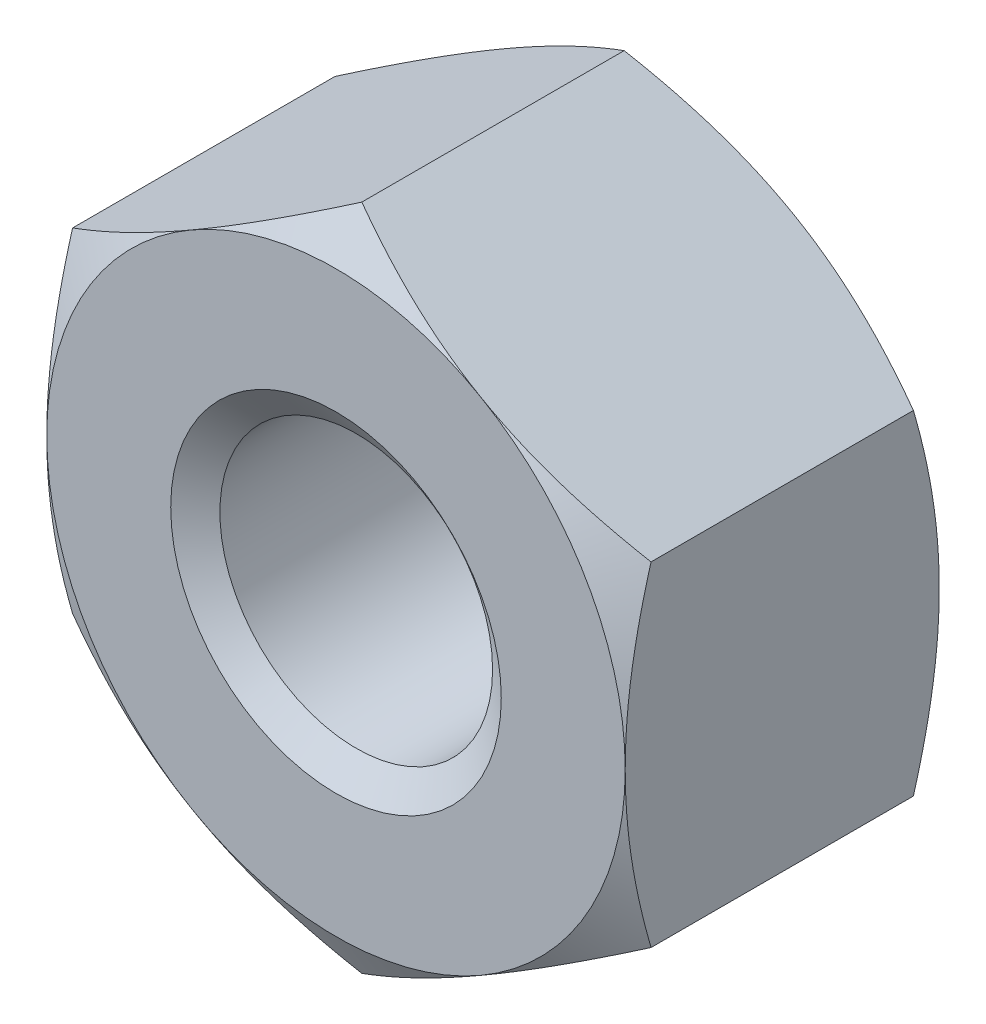
ISO-10303-21;
HEADER;
FILE_DESCRIPTION(('STEP AP214'),'2;1');
FILE_NAME('part.step','',(''),(''),'','','');
FILE_SCHEMA(('AUTOMOTIVE_DESIGN { 1 0 10303 214 1 1 1 1 }'));
ENDSEC;
DATA;
#1=APPLICATION_CONTEXT('core data for automotive mechanical design processes');
#2=APPLICATION_PROTOCOL_DEFINITION('international standard','automotive_design',2000,#1);
#3=PRODUCT_CONTEXT('',#1,'mechanical');
#4=PRODUCT('Part','Part','',(#3));
#5=PRODUCT_RELATED_PRODUCT_CATEGORY('part','',(#4));
#6=PRODUCT_DEFINITION_FORMATION('','',#4);
#7=PRODUCT_DEFINITION_CONTEXT('part definition',#1,'design');
#8=PRODUCT_DEFINITION('design','',#6,#7);
#9=PRODUCT_DEFINITION_SHAPE('','',#8);
#10=(LENGTH_UNIT() NAMED_UNIT(*) SI_UNIT(.MILLI.,.METRE.));
#11=(NAMED_UNIT(*) PLANE_ANGLE_UNIT() SI_UNIT($,.RADIAN.));
#12=(NAMED_UNIT(*) SI_UNIT($,.STERADIAN.) SOLID_ANGLE_UNIT());
#13=UNCERTAINTY_MEASURE_WITH_UNIT(LENGTH_MEASURE(1.E-05),#10,'distance_accuracy_value','');
#14=(GEOMETRIC_REPRESENTATION_CONTEXT(3) GLOBAL_UNCERTAINTY_ASSIGNED_CONTEXT((#13)) GLOBAL_UNIT_ASSIGNED_CONTEXT((#10,
#11,#12)) REPRESENTATION_CONTEXT('',''));
#15=CARTESIAN_POINT('',(0.,0.,0.));
#16=DIRECTION('',(0.,0.,1.));
#17=DIRECTION('',(1.,0.,0.));
#18=AXIS2_PLACEMENT_3D('',#15,#16,#17);
#19=CARTESIAN_POINT('',(0.,0.,-3.8));
#20=DIRECTION('',(0.,0.,1.));
#21=DIRECTION('',(1.,0.,0.));
#22=AXIS2_PLACEMENT_3D('',#19,#20,#21);
#23=CYLINDRICAL_SURFACE('',#22,1.65);
#24=CARTESIAN_POINT('',(0.,0.,-0.245072638373399));
#25=DIRECTION('',(0.,0.,1.));
#26=DIRECTION('',(1.,0.,0.));
#27=AXIS2_PLACEMENT_3D('',#24,#25,#26);
#28=CIRCLE('',#27,1.65);
#29=CARTESIAN_POINT('',(1.65,0.,-0.245072638373399));
#30=VERTEX_POINT('',#29);
#31=EDGE_CURVE('E174',#30,#30,#28,.F.);
#32=CARTESIAN_POINT('',(0.,0.,-3.5295273616266));
#33=DIRECTION('',(0.,0.,-1.));
#34=DIRECTION('',(-1.,0.,0.));
#35=AXIS2_PLACEMENT_3D('',#32,#33,#34);
#36=CIRCLE('',#35,1.65);
#37=CARTESIAN_POINT('',(1.65,0.,-3.5295273616266));
#38=VERTEX_POINT('',#37);
#39=EDGE_CURVE('E39',#38,#38,#36,.F.);
#40=CARTESIAN_POINT('',(1.65,0.,-0.245072638373399));
#41=CARTESIAN_POINT('',(1.65,0.,-0.279285708407287));
#42=CARTESIAN_POINT('',(1.65,0.,-0.313498778441174));
#43=CARTESIAN_POINT('',(1.65,0.,-0.381924918508949));
#44=CARTESIAN_POINT('',(1.65,0.,-0.416137988542837));
#45=CARTESIAN_POINT('',(1.65,0.,-0.484564128610612));
#46=CARTESIAN_POINT('',(1.65,0.,-0.518777198644499));
#47=CARTESIAN_POINT('',(1.65,0.,-0.587203338712274));
#48=CARTESIAN_POINT('',(1.65,0.,-0.621416408746162));
#49=CARTESIAN_POINT('',(1.65,0.,-0.689842548813937));
#50=CARTESIAN_POINT('',(1.65,0.,-0.724055618847824));
#51=CARTESIAN_POINT('',(1.65,0.,-0.792481758915599));
#52=CARTESIAN_POINT('',(1.65,0.,-0.826694828949487));
#53=CARTESIAN_POINT('',(1.65,0.,-0.895120969017262));
#54=CARTESIAN_POINT('',(1.65,0.,-0.929334039051149));
#55=CARTESIAN_POINT('',(1.65,0.,-0.997760179118924));
#56=CARTESIAN_POINT('',(1.65,0.,-1.03197324915281));
#57=CARTESIAN_POINT('',(1.65,0.,-1.10039938922059));
#58=CARTESIAN_POINT('',(1.65,0.,-1.13461245925447));
#59=CARTESIAN_POINT('',(1.65,0.,-1.20303859932225));
#60=CARTESIAN_POINT('',(1.65,0.,-1.23725166935614));
#61=CARTESIAN_POINT('',(1.65,0.,-1.30567780942391));
#62=CARTESIAN_POINT('',(1.65,0.,-1.3398908794578));
#63=CARTESIAN_POINT('',(1.65,0.,-1.40831701952557));
#64=CARTESIAN_POINT('',(1.65,0.,-1.44253008955946));
#65=CARTESIAN_POINT('',(1.65,0.,-1.51095622962724));
#66=CARTESIAN_POINT('',(1.65,0.,-1.54516929966112));
#67=CARTESIAN_POINT('',(1.65,0.,-1.6135954397289));
#68=CARTESIAN_POINT('',(1.65,0.,-1.64780850976279));
#69=CARTESIAN_POINT('',(1.65,0.,-1.71623464983056));
#70=CARTESIAN_POINT('',(1.65,0.,-1.75044771986445));
#71=CARTESIAN_POINT('',(1.65,0.,-1.81887385993222));
#72=CARTESIAN_POINT('',(1.65,0.,-1.85308692996611));
#73=CARTESIAN_POINT('',(1.65,0.,-1.92151307003389));
#74=CARTESIAN_POINT('',(1.65,0.,-1.95572614006777));
#75=CARTESIAN_POINT('',(1.65,0.,-2.02415228013555));
#76=CARTESIAN_POINT('',(1.65,0.,-2.05836535016944));
#77=CARTESIAN_POINT('',(1.65,0.,-2.12679149023721));
#78=CARTESIAN_POINT('',(1.65,0.,-2.1610045602711));
#79=CARTESIAN_POINT('',(1.65,0.,-2.22943070033887));
#80=CARTESIAN_POINT('',(1.65,0.,-2.26364377037276));
#81=CARTESIAN_POINT('',(1.65,0.,-2.33206991044054));
#82=CARTESIAN_POINT('',(1.65,0.,-2.36628298047442));
#83=CARTESIAN_POINT('',(1.65,0.,-2.4347091205422));
#84=CARTESIAN_POINT('',(1.65,0.,-2.46892219057609));
#85=CARTESIAN_POINT('',(1.65,0.,-2.53734833064386));
#86=CARTESIAN_POINT('',(1.65,0.,-2.57156140067775));
#87=CARTESIAN_POINT('',(1.65,0.,-2.63998754074552));
#88=CARTESIAN_POINT('',(1.65,0.,-2.67420061077941));
#89=CARTESIAN_POINT('',(1.65,0.,-2.74262675084719));
#90=CARTESIAN_POINT('',(1.65,0.,-2.77683982088107));
#91=CARTESIAN_POINT('',(1.65,0.,-2.84526596094885));
#92=CARTESIAN_POINT('',(1.65,0.,-2.87947903098274));
#93=CARTESIAN_POINT('',(1.65,0.,-2.94790517105051));
#94=CARTESIAN_POINT('',(1.65,0.,-2.9821182410844));
#95=CARTESIAN_POINT('',(1.65,0.,-3.05054438115217));
#96=CARTESIAN_POINT('',(1.65,0.,-3.08475745118606));
#97=CARTESIAN_POINT('',(1.65,0.,-3.15318359125384));
#98=CARTESIAN_POINT('',(1.65,0.,-3.18739666128773));
#99=CARTESIAN_POINT('',(1.65,0.,-3.2558228013555));
#100=CARTESIAN_POINT('',(1.65,0.,-3.29003587138939));
#101=CARTESIAN_POINT('',(1.65,0.,-3.35846201145716));
#102=CARTESIAN_POINT('',(1.65,0.,-3.39267508149105));
#103=CARTESIAN_POINT('',(1.65,0.,-3.46110122155882));
#104=CARTESIAN_POINT('',(1.65,0.,-3.49531429159271));
#105=CARTESIAN_POINT('',(1.65,0.,-3.5295273616266));
#106=B_SPLINE_CURVE_WITH_KNOTS('',3,(#40,#41,#42,#43,#44,#45,#46,#47,#48,#49,#50,#51,#52,#53,
#54,#55,#56,#57,#58,#59,#60,#61,#62,#63,#64,#65,#66,#67,#68,#69,#70,#71,#72,#73,#74,#75,#76,#77,
#78,#79,#80,#81,#82,#83,#84,#85,#86,#87,#88,#89,#90,#91,#92,#93,#94,#95,#96,#97,#98,#99,#100,
#101,#102,#103,#104,#105),.UNSPECIFIED.,.F.,.F.,(4,2,2,2,2,2,2,2,2,2,2,2,2,2,2,2,2,2,2,2,2,2,2,
2,2,2,2,2,2,2,2,2,4),(0.,0.102639210101662,0.205278420203325,0.307917630304987,0.41055684040665,
0.513196050508312,0.615835260609975,0.718474470711638,0.8211136808133,0.923752890914963,
1.02639210101663,1.12903131111829,1.23167052121995,1.33430973132161,1.43694894142328,
1.53958815152494,1.6422273616266,1.74486657172826,1.84750578182993,1.95014499193159,
2.05278420203325,2.15542341213491,2.25806262223658,2.36070183233824,2.4633410424399,
2.56598025254156,2.66861946264323,2.77125867274489,2.87389788284655,2.97653709294821,
3.07917630304988,3.18181551315154,3.2844547232532),.UNSPECIFIED.);
#107=EDGE_CURVE('BSEAM34',#30,#38,#106,.T.);
#108=ORIENTED_EDGE('',*,*,#31,.F.);
#109=ORIENTED_EDGE('',*,*,#39,.F.);
#110=ORIENTED_EDGE('',*,*,#107,.T.);
#111=ORIENTED_EDGE('',*,*,#107,.F.);
#112=EDGE_LOOP('',(#108,#110,#109,#111));
#113=FACE_BOUND('',#112,.T.);
#114=ADVANCED_FACE('F34',(#113),#23,.F.);
#115=CARTESIAN_POINT('',(0.,4.04145188432738,-3.8));
#116=DIRECTION('',(-0.500000000000001,0.866025403784438,0.));
#117=DIRECTION('',(-0.866025403784438,-0.500000000000001,0.));
#118=AXIS2_PLACEMENT_3D('',#115,#116,#117);
#119=PLANE('',#118);
#120=DIRECTION('',(0.,0.,1.));
#121=VECTOR('',#120,1.);
#122=CARTESIAN_POINT('',(-3.5,2.02072594216369,-3.8));
#123=LINE('',#122,#121);
#124=CARTESIAN_POINT('',(-3.5,2.02072594216369,-3.48739260883035));
#125=VERTEX_POINT('',#124);
#126=CARTESIAN_POINT('',(-3.5,2.02072594216369,-0.312607391169643));
#127=VERTEX_POINT('',#126);
#128=EDGE_CURVE('E164',#125,#127,#123,.T.);
#129=ORIENTED_EDGE('',*,*,#128,.T.);
#130=CARTESIAN_POINT('',(-3.5002,2.02061047210985,-0.312674060693371));
#131=CARTESIAN_POINT('',(-3.34639282154755,2.10941108799267,-0.261385788989983));
#132=CARTESIAN_POINT('',(-3.19125798916558,2.19897822522909,-0.214740953816197));
#133=CARTESIAN_POINT('',(-2.87830199342322,2.37966345361545,-0.133321875533348));
#134=CARTESIAN_POINT('',(-2.7204752692125,2.47078475532382,-0.0985764355845608));
#135=CARTESIAN_POINT('',(-2.40677778961987,2.65189807961073,-0.0444900271828353));
#136=CARTESIAN_POINT('',(-2.25095530083931,2.74186223545399,-0.0247890862603807));
#137=CARTESIAN_POINT('',(-1.93857711279463,2.92221386641056,-0.00127013273725369));
#138=CARTESIAN_POINT('',(-1.78202254896577,3.01260068598001,0.00256735545443515));
#139=CARTESIAN_POINT('',(-1.48949078007901,3.1814939814933,-0.00541530187697757));
#140=CARTESIAN_POINT('',(-1.35346978754209,3.26002573814993,-0.015275434069607));
#141=CARTESIAN_POINT('',(-1.08231397971101,3.41657761679354,-0.0465264668994037));
#142=CARTESIAN_POINT('',(-0.947180102315317,3.49459719728458,-0.0679280432857986));
#143=CARTESIAN_POINT('',(-0.675465207594817,3.65147186489429,-0.121430407880578));
#144=CARTESIAN_POINT('',(-0.538918580721665,3.73030709667644,-0.153757994445088));
#145=CARTESIAN_POINT('',(-0.267861907055499,3.88680174018324,-0.227128933807996));
#146=CARTESIAN_POINT('',(-0.133348387531464,3.96446315689009,-0.268155046569869));
#147=CARTESIAN_POINT('',(0.000199999999999687,4.04156735438122,-0.312674060693373));
#148=B_SPLINE_CURVE_WITH_KNOTS('',3,(#130,#131,#132,#133,#134,#135,#136,#137,#138,#139,#140,
#141,#142,#143,#144,#145,#146,#147),.UNSPECIFIED.,.F.,.F.,(4,2,2,2,2,2,2,2,4),(0.,
0.554793832886254,1.11092123814984,1.65328467083219,2.19498204478403,2.6666513085086,
3.13875761298267,3.6213361260051,4.10296698719187),.UNSPECIFIED.);
#149=CARTESIAN_POINT('',(-1.75,3.03108891324553,0.));
#150=VERTEX_POINT('',#149);
#151=EDGE_CURVE('E133',#127,#150,#148,.T.);
#152=ORIENTED_EDGE('',*,*,#151,.T.);
#153=CARTESIAN_POINT('',(0.,4.04145188432738,-0.312607391169645));
#154=VERTEX_POINT('',#153);
#155=EDGE_CURVE('E53',#150,#154,#148,.T.);
#156=ORIENTED_EDGE('',*,*,#155,.T.);
#157=DIRECTION('',(0.,0.,1.));
#158=VECTOR('',#157,1.);
#159=CARTESIAN_POINT('',(0.,4.04145188432738,-3.8));
#160=LINE('',#159,#158);
#161=CARTESIAN_POINT('',(0.,4.04145188432738,-3.48739260883035));
#162=VERTEX_POINT('',#161);
#163=EDGE_CURVE('E149',#162,#154,#160,.T.);
#164=ORIENTED_EDGE('',*,*,#163,.F.);
#165=CARTESIAN_POINT('',(-3.5002,2.02061047210985,-3.48732593930663));
#166=CARTESIAN_POINT('',(-3.34639282154755,2.10941108799267,-3.53861421101002));
#167=CARTESIAN_POINT('',(-3.19125798916558,2.19897822522909,-3.5852590461838));
#168=CARTESIAN_POINT('',(-2.87830199342322,2.37966345361545,-3.66667812446665));
#169=CARTESIAN_POINT('',(-2.7204752692125,2.47078475532382,-3.70142356441544));
#170=CARTESIAN_POINT('',(-2.40677778961987,2.65189807961073,-3.75550997281716));
#171=CARTESIAN_POINT('',(-2.25095530083931,2.74186223545399,-3.77521091373962));
#172=CARTESIAN_POINT('',(-1.93857711279463,2.92221386641056,-3.79872986726275));
#173=CARTESIAN_POINT('',(-1.78202254896577,3.01260068598001,-3.80256735545444));
#174=CARTESIAN_POINT('',(-1.48949078007901,3.1814939814933,-3.79458469812302));
#175=CARTESIAN_POINT('',(-1.35346978754209,3.26002573814993,-3.78472456593039));
#176=CARTESIAN_POINT('',(-1.08231397971101,3.41657761679354,-3.7534735331006));
#177=CARTESIAN_POINT('',(-0.947180102315317,3.49459719728458,-3.7320719567142));
#178=CARTESIAN_POINT('',(-0.675465207594816,3.65147186489429,-3.67856959211942));
#179=CARTESIAN_POINT('',(-0.538918580721665,3.73030709667644,-3.64624200555491));
#180=CARTESIAN_POINT('',(-0.267861907055499,3.88680174018324,-3.572871066192));
#181=CARTESIAN_POINT('',(-0.133348387531464,3.96446315689009,-3.53184495343013));
#182=CARTESIAN_POINT('',(0.000199999999999684,4.04156735438122,-3.48732593930663));
#183=B_SPLINE_CURVE_WITH_KNOTS('',3,(#165,#166,#167,#168,#169,#170,#171,#172,#173,#174,#175,
#176,#177,#178,#179,#180,#181,#182),.UNSPECIFIED.,.F.,.F.,(4,2,2,2,2,2,2,2,4),(0.,
0.554793832886255,1.11092123814984,1.65328467083219,2.19498204478403,2.6666513085086,
3.13875761298267,3.6213361260051,4.10296698719187),.UNSPECIFIED.);
#184=CARTESIAN_POINT('',(-1.75,3.03108891324553,-3.8));
#185=VERTEX_POINT('',#184);
#186=EDGE_CURVE('E167',#185,#162,#183,.T.);
#187=ORIENTED_EDGE('',*,*,#186,.F.);
#188=EDGE_CURVE('E259',#125,#185,#183,.T.);
#189=ORIENTED_EDGE('',*,*,#188,.F.);
#190=EDGE_LOOP('',(#129,#152,#156,#164,#187,#189));
#191=FACE_BOUND('',#190,.T.);
#192=ADVANCED_FACE('F36',(#191),#119,.T.);
#193=CARTESIAN_POINT('',(3.5,2.02072594216369,-3.8));
#194=DIRECTION('',(0.500000000000001,0.866025403784438,0.));
#195=DIRECTION('',(-0.866025403784438,0.500000000000001,0.));
#196=AXIS2_PLACEMENT_3D('',#193,#194,#195);
#197=PLANE('',#196);
#198=ORIENTED_EDGE('',*,*,#163,.T.);
#199=CARTESIAN_POINT('',(-0.000200000000000259,4.04156735438122,-0.312674060693373));
#200=CARTESIAN_POINT('',(0.153607178452449,3.9527667384984,-0.261385788989986));
#201=CARTESIAN_POINT('',(0.308742010834424,3.86319960126198,-0.214740953816199));
#202=CARTESIAN_POINT('',(0.621698006576782,3.68251437287562,-0.13332187553335));
#203=CARTESIAN_POINT('',(0.779524730787496,3.59139307116725,-0.0985764355845619));
#204=CARTESIAN_POINT('',(1.09322221038013,3.41027974688034,-0.0444900271828362));
#205=CARTESIAN_POINT('',(1.24904469916069,3.32031559103708,-0.0247890862603816));
#206=CARTESIAN_POINT('',(1.56142288720538,3.13996396008052,-0.00127013273725425));
#207=CARTESIAN_POINT('',(1.71797745103423,3.04957714051106,0.00256735545443501));
#208=CARTESIAN_POINT('',(2.01050921992099,2.88068384499777,-0.00541530187697743));
#209=CARTESIAN_POINT('',(2.14653021245791,2.80215208834114,-0.0152754340696069));
#210=CARTESIAN_POINT('',(2.417686020289,2.64560020969753,-0.0465264668994034));
#211=CARTESIAN_POINT('',(2.55281989768468,2.5675806292065,-0.067928043285798));
#212=CARTESIAN_POINT('',(2.82453479240518,2.41070596159678,-0.121430407880577));
#213=CARTESIAN_POINT('',(2.96108141927834,2.33187072981463,-0.153757994445087));
#214=CARTESIAN_POINT('',(3.2321380929445,2.17537608630783,-0.227128933807994));
#215=CARTESIAN_POINT('',(3.36665161246854,2.09771466960098,-0.268155046569867));
#216=CARTESIAN_POINT('',(3.5002,2.02061047210985,-0.312674060693371));
#217=B_SPLINE_CURVE_WITH_KNOTS('',3,(#199,#200,#201,#202,#203,#204,#205,#206,#207,#208,#209,
#210,#211,#212,#213,#214,#215,#216),.UNSPECIFIED.,.F.,.F.,(4,2,2,2,2,2,2,2,4),(0.,
0.554793832886255,1.11092123814984,1.65328467083219,2.19498204478403,2.6666513085086,
3.13875761298267,3.6213361260051,4.10296698719187),.UNSPECIFIED.);
#218=CARTESIAN_POINT('',(1.75,3.03108891324553,0.));
#219=VERTEX_POINT('',#218);
#220=EDGE_CURVE('E143',#154,#219,#217,.T.);
#221=ORIENTED_EDGE('',*,*,#220,.T.);
#222=CARTESIAN_POINT('',(3.5,2.02072594216369,-0.312607391169645));
#223=VERTEX_POINT('',#222);
#224=EDGE_CURVE('E60',#219,#223,#217,.T.);
#225=ORIENTED_EDGE('',*,*,#224,.T.);
#226=DIRECTION('',(0.,0.,1.));
#227=VECTOR('',#226,1.);
#228=CARTESIAN_POINT('',(3.5,2.02072594216369,-3.8));
#229=LINE('',#228,#227);
#230=CARTESIAN_POINT('',(3.5,2.02072594216369,-3.48739260883035));
#231=VERTEX_POINT('',#230);
#232=EDGE_CURVE('E142',#231,#223,#229,.T.);
#233=ORIENTED_EDGE('',*,*,#232,.F.);
#234=CARTESIAN_POINT('',(-0.000200000000000244,4.04156735438122,-3.48732593930663));
#235=CARTESIAN_POINT('',(0.153607178452449,3.9527667384984,-3.53861421101001));
#236=CARTESIAN_POINT('',(0.308742010834424,3.86319960126198,-3.5852590461838));
#237=CARTESIAN_POINT('',(0.621698006576782,3.68251437287562,-3.66667812446665));
#238=CARTESIAN_POINT('',(0.779524730787496,3.59139307116725,-3.70142356441544));
#239=CARTESIAN_POINT('',(1.09322221038013,3.41027974688034,-3.75550997281716));
#240=CARTESIAN_POINT('',(1.24904469916069,3.32031559103708,-3.77521091373962));
#241=CARTESIAN_POINT('',(1.56142288720538,3.13996396008052,-3.79872986726275));
#242=CARTESIAN_POINT('',(1.71797745103423,3.04957714051106,-3.80256735545443));
#243=CARTESIAN_POINT('',(2.01050921992099,2.88068384499777,-3.79458469812302));
#244=CARTESIAN_POINT('',(2.14653021245791,2.80215208834114,-3.78472456593039));
#245=CARTESIAN_POINT('',(2.417686020289,2.64560020969753,-3.7534735331006));
#246=CARTESIAN_POINT('',(2.55281989768468,2.5675806292065,-3.7320719567142));
#247=CARTESIAN_POINT('',(2.82453479240518,2.41070596159678,-3.67856959211942));
#248=CARTESIAN_POINT('',(2.96108141927834,2.33187072981463,-3.64624200555491));
#249=CARTESIAN_POINT('',(3.2321380929445,2.17537608630783,-3.57287106619201));
#250=CARTESIAN_POINT('',(3.36665161246854,2.09771466960098,-3.53184495343013));
#251=CARTESIAN_POINT('',(3.5002,2.02061047210985,-3.48732593930663));
#252=B_SPLINE_CURVE_WITH_KNOTS('',3,(#234,#235,#236,#237,#238,#239,#240,#241,#242,#243,#244,
#245,#246,#247,#248,#249,#250,#251),.UNSPECIFIED.,.F.,.F.,(4,2,2,2,2,2,2,2,4),(0.,
0.554793832886255,1.11092123814984,1.65328467083219,2.19498204478403,2.6666513085086,
3.13875761298267,3.6213361260051,4.10296698719187),.UNSPECIFIED.);
#253=CARTESIAN_POINT('',(1.75,3.03108891324553,-3.8));
#254=VERTEX_POINT('',#253);
#255=EDGE_CURVE('E253',#254,#231,#252,.T.);
#256=ORIENTED_EDGE('',*,*,#255,.F.);
#257=EDGE_CURVE('E258',#162,#254,#252,.T.);
#258=ORIENTED_EDGE('',*,*,#257,.F.);
#259=EDGE_LOOP('',(#198,#221,#225,#233,#256,#258));
#260=FACE_BOUND('',#259,.T.);
#261=ADVANCED_FACE('F140',(#260),#197,.T.);
#262=CARTESIAN_POINT('',(3.5,2.02072594216369,-3.8));
#263=DIRECTION('',(-1.,0.,0.));
#264=DIRECTION('',(0.,0.,1.));
#265=AXIS2_PLACEMENT_3D('',#262,#263,#264);
#266=PLANE('',#265);
#267=CARTESIAN_POINT('',(3.5,-5.35926299121405,-1.67484346858556));
#268=CARTESIAN_POINT('',(3.5,-5.20559319908842,-1.60058173692104));
#269=CARTESIAN_POINT('',(3.5,-5.05156008083375,-1.52705822833147));
#270=CARTESIAN_POINT('',(3.5,-4.7425707418071,-1.38190950344752));
#271=CARTESIAN_POINT('',(3.5,-4.58761436682436,-1.31028461582133));
#272=CARTESIAN_POINT('',(3.5,-4.27574500225542,-1.16897765517624));
#273=CARTESIAN_POINT('',(3.5,-4.11882589028192,-1.09930904568016));
#274=CARTESIAN_POINT('',(3.5,-3.80369792903855,-0.96296426224276));
#275=CARTESIAN_POINT('',(3.5,-3.64548914750595,-0.896287932319518));
#276=CARTESIAN_POINT('',(3.5,-3.32556618401855,-0.765931819095067));
#277=CARTESIAN_POINT('',(3.5,-3.16383281219923,-0.702298873688864));
#278=CARTESIAN_POINT('',(3.5,-2.83845840945597,-0.580016702089492));
#279=CARTESIAN_POINT('',(3.5,-2.67481716858826,-0.521368030370691));
#280=CARTESIAN_POINT('',(3.5,-2.34570278472049,-0.410630279877021));
#281=CARTESIAN_POINT('',(3.5,-2.18023438248742,-0.358527255435857));
#282=CARTESIAN_POINT('',(3.5,-1.8469452280637,-0.262572936976443));
#283=CARTESIAN_POINT('',(3.5,-1.6791252378753,-0.218719033467158));
#284=CARTESIAN_POINT('',(3.5,-1.34101828610925,-0.141391945584786));
#285=CARTESIAN_POINT('',(3.5,-1.17073068027693,-0.107921525211972));
#286=CARTESIAN_POINT('',(3.5,-0.828102385138484,-0.0536149564320502));
#287=CARTESIAN_POINT('',(3.5,-0.655761694017301,-0.0327788191952362));
#288=CARTESIAN_POINT('',(3.5,-0.311020490924449,-0.00558408650575641));
#289=CARTESIAN_POINT('',(3.5,-0.138627397207259,0.00086616316591138));
#290=CARTESIAN_POINT('',(3.5,0.206038074906536,-0.00105355807794622));
#291=CARTESIAN_POINT('',(3.5,0.37831047302318,-0.00941968196343206));
#292=CARTESIAN_POINT('',(3.5,0.672490555822328,-0.035768892786892));
#293=CARTESIAN_POINT('',(3.5,0.794722791084093,-0.0503206340384212));
#294=CARTESIAN_POINT('',(3.5,1.0382430543056,-0.0859367340533556));
#295=CARTESIAN_POINT('',(3.5,1.15953093025887,-0.107002119926141));
#296=CARTESIAN_POINT('',(3.5,1.52187914771348,-0.178863187081453));
#297=CARTESIAN_POINT('',(3.5,1.76124104212632,-0.23830527562201));
#298=CARTESIAN_POINT('',(3.5,2.11940971387708,-0.340826814402554));
#299=CARTESIAN_POINT('',(3.5,2.24008344316346,-0.377749699085183));
#300=CARTESIAN_POINT('',(3.5,2.48017139213728,-0.455249007699293));
#301=CARTESIAN_POINT('',(3.5,2.59958641795613,-0.49582291166355));
#302=CARTESIAN_POINT('',(3.5,2.83665760451798,-0.579779986782753));
#303=CARTESIAN_POINT('',(3.5,2.95431988203483,-0.623146060034315));
#304=CARTESIAN_POINT('',(3.5,3.188731535088,-0.712423559566867));
#305=CARTESIAN_POINT('',(3.5,3.30548051959464,-0.758336014592951));
#306=CARTESIAN_POINT('',(3.5,3.42180736613349,-0.805270380724071));
#307=B_SPLINE_CURVE_WITH_KNOTS('',3,(#267,#268,#269,#270,#271,#272,#273,#274,#275,#276,#277,
#278,#279,#280,#281,#282,#283,#284,#285,#286,#287,#288,#289,#290,#291,#292,#293,#294,#295,#296,
#297,#298,#299,#300,#301,#302,#303,#304,#305,#306),.UNSPECIFIED.,.F.,.F.,(4,2,2,2,2,2,2,2,2,2,2,
2,2,2,2,2,2,2,2,4),(0.,0.512025318465737,1.02413870177436,1.53918270315241,2.05419982499224,
2.57553975872798,3.09693761309353,3.617205066104,4.13730766217537,4.65754858684364,
5.17778997146961,5.69470725122282,6.211490334524,6.58059623222331,6.94976036239485,
7.68863804939851,8.06719621660478,8.4454950747676,8.82166461280099,9.1979872473341),.UNSPECIFIED.);
#308=CARTESIAN_POINT('',(3.5,-2.02072594216369,-0.312607391169645));
#309=VERTEX_POINT('',#308);
#310=CARTESIAN_POINT('',(3.5,0.,0.));
#311=VERTEX_POINT('',#310);
#312=EDGE_CURVE('E135',#309,#311,#307,.T.);
#313=ORIENTED_EDGE('',*,*,#312,.F.);
#314=DIRECTION('',(0.,0.,1.));
#315=VECTOR('',#314,1.);
#316=CARTESIAN_POINT('',(3.5,-2.02072594216369,-3.8));
#317=LINE('',#316,#315);
#318=CARTESIAN_POINT('',(3.5,-2.02072594216369,-3.48739260883035));
#319=VERTEX_POINT('',#318);
#320=EDGE_CURVE('E150',#319,#309,#317,.T.);
#321=ORIENTED_EDGE('',*,*,#320,.F.);
#322=CARTESIAN_POINT('',(3.5,-5.35926299121405,-2.12515653141444));
#323=CARTESIAN_POINT('',(3.5,-5.20559319908841,-2.19941826307896));
#324=CARTESIAN_POINT('',(3.5,-5.05156008083375,-2.27294177166853));
#325=CARTESIAN_POINT('',(3.5,-4.7425707418071,-2.41809049655248));
#326=CARTESIAN_POINT('',(3.5,-4.58761436682436,-2.48971538417867));
#327=CARTESIAN_POINT('',(3.5,-4.27574500225542,-2.63102234482376));
#328=CARTESIAN_POINT('',(3.5,-4.11882589028192,-2.70069095431984));
#329=CARTESIAN_POINT('',(3.5,-3.80369792903855,-2.83703573775724));
#330=CARTESIAN_POINT('',(3.5,-3.64548914750595,-2.90371206768048));
#331=CARTESIAN_POINT('',(3.5,-3.32556618401855,-3.03406818090493));
#332=CARTESIAN_POINT('',(3.5,-3.16383281219923,-3.09770112631114));
#333=CARTESIAN_POINT('',(3.5,-2.83845840945597,-3.21998329791051));
#334=CARTESIAN_POINT('',(3.5,-2.67481716858826,-3.27863196962931));
#335=CARTESIAN_POINT('',(3.5,-2.34570278472049,-3.38936972012298));
#336=CARTESIAN_POINT('',(3.5,-2.18023438248742,-3.44147274456414));
#337=CARTESIAN_POINT('',(3.5,-1.8469452280637,-3.53742706302356));
#338=CARTESIAN_POINT('',(3.5,-1.6791252378753,-3.58128096653284));
#339=CARTESIAN_POINT('',(3.5,-1.34101828610925,-3.65860805441521));
#340=CARTESIAN_POINT('',(3.5,-1.17073068027693,-3.69207847478803));
#341=CARTESIAN_POINT('',(3.5,-0.828102385138483,-3.74638504356795));
#342=CARTESIAN_POINT('',(3.5,-0.655761694017301,-3.76722118080476));
#343=CARTESIAN_POINT('',(3.5,-0.311020490924449,-3.79441591349424));
#344=CARTESIAN_POINT('',(3.5,-0.138627397207259,-3.80086616316591));
#345=CARTESIAN_POINT('',(3.5,0.206038074906536,-3.79894644192205));
#346=CARTESIAN_POINT('',(3.5,0.378310473023181,-3.79058031803657));
#347=CARTESIAN_POINT('',(3.5,0.672490555822328,-3.76423110721311));
#348=CARTESIAN_POINT('',(3.5,0.794722791084093,-3.74967936596158));
#349=CARTESIAN_POINT('',(3.5,1.0382430543056,-3.71406326594664));
#350=CARTESIAN_POINT('',(3.5,1.15953093025887,-3.69299788007386));
#351=CARTESIAN_POINT('',(3.5,1.52187914771348,-3.62113681291855));
#352=CARTESIAN_POINT('',(3.5,1.76124104212632,-3.56169472437799));
#353=CARTESIAN_POINT('',(3.5,2.11940971387708,-3.45917318559745));
#354=CARTESIAN_POINT('',(3.5,2.24008344316346,-3.42225030091482));
#355=CARTESIAN_POINT('',(3.5,2.48017139213728,-3.34475099230071));
#356=CARTESIAN_POINT('',(3.5,2.59958641795613,-3.30417708833645));
#357=CARTESIAN_POINT('',(3.5,2.83665760451798,-3.22022001321725));
#358=CARTESIAN_POINT('',(3.5,2.95431988203483,-3.17685393996569));
#359=CARTESIAN_POINT('',(3.5,3.188731535088,-3.08757644043313));
#360=CARTESIAN_POINT('',(3.5,3.30548051959464,-3.04166398540705));
#361=CARTESIAN_POINT('',(3.5,3.42180736613349,-2.99472961927593));
#362=B_SPLINE_CURVE_WITH_KNOTS('',3,(#322,#323,#324,#325,#326,#327,#328,#329,#330,#331,#332,
#333,#334,#335,#336,#337,#338,#339,#340,#341,#342,#343,#344,#345,#346,#347,#348,#349,#350,#351,
#352,#353,#354,#355,#356,#357,#358,#359,#360,#361),.UNSPECIFIED.,.F.,.F.,(4,2,2,2,2,2,2,2,2,2,2,
2,2,2,2,2,2,2,2,4),(0.,0.512025318465738,1.02413870177436,1.53918270315241,2.05419982499224,
2.57553975872798,3.09693761309353,3.617205066104,4.13730766217537,4.65754858684365,
5.17778997146961,5.69470725122282,6.21149033452401,6.58059623222331,6.94976036239485,
7.68863804939851,8.06719621660478,8.4454950747676,8.82166461280099,9.1979872473341),.UNSPECIFIED.);
#363=CARTESIAN_POINT('',(3.5,0.,-3.8));
#364=VERTEX_POINT('',#363);
#365=EDGE_CURVE('E265',#319,#364,#362,.T.);
#366=ORIENTED_EDGE('',*,*,#365,.T.);
#367=EDGE_CURVE('E148',#364,#231,#362,.T.);
#368=ORIENTED_EDGE('',*,*,#367,.T.);
#369=ORIENTED_EDGE('',*,*,#232,.T.);
#370=EDGE_CURVE('E125',#311,#223,#307,.T.);
#371=ORIENTED_EDGE('',*,*,#370,.F.);
#372=EDGE_LOOP('',(#313,#321,#366,#368,#369,#371));
#373=FACE_BOUND('',#372,.T.);
#374=ADVANCED_FACE('F146',(#373),#266,.F.);
#375=CARTESIAN_POINT('',(0.,-4.04145188432739,-3.8));
#376=DIRECTION('',(0.500000000000001,-0.866025403784438,0.));
#377=DIRECTION('',(0.866025403784438,0.500000000000001,0.));
#378=AXIS2_PLACEMENT_3D('',#375,#376,#377);
#379=PLANE('',#378);
#380=ORIENTED_EDGE('',*,*,#320,.T.);
#381=CARTESIAN_POINT('',(3.5002,-2.02061047210985,-0.312674060693373));
#382=CARTESIAN_POINT('',(3.34639282154755,-2.10941108799267,-0.261385788989985));
#383=CARTESIAN_POINT('',(3.19125798916558,-2.19897822522909,-0.214740953816198));
#384=CARTESIAN_POINT('',(2.87830199342322,-2.37966345361545,-0.13332187553335));
#385=CARTESIAN_POINT('',(2.7204752692125,-2.47078475532382,-0.0985764355845621));
#386=CARTESIAN_POINT('',(2.40677778961987,-2.65189807961074,-0.0444900271828368));
#387=CARTESIAN_POINT('',(2.25095530083931,-2.741862235454,-0.0247890862603824));
#388=CARTESIAN_POINT('',(1.93857711279463,-2.92221386641056,-0.00127013273725548));
#389=CARTESIAN_POINT('',(1.78202254896577,-3.01260068598001,0.0025673554544335));
#390=CARTESIAN_POINT('',(1.48949078007901,-3.1814939814933,-0.0054153018769794));
#391=CARTESIAN_POINT('',(1.35346978754209,-3.26002573814993,-0.0152754340696091));
#392=CARTESIAN_POINT('',(1.082313979711,-3.41657761679354,-0.0465264668994058));
#393=CARTESIAN_POINT('',(0.947180102315317,-3.49459719728458,-0.0679280432858004));
#394=CARTESIAN_POINT('',(0.675465207594816,-3.65147186489429,-0.12143040788058));
#395=CARTESIAN_POINT('',(0.538918580721664,-3.73030709667644,-0.15375799444509));
#396=CARTESIAN_POINT('',(0.267861907055498,-3.88680174018325,-0.227128933807997));
#397=CARTESIAN_POINT('',(0.133348387531464,-3.96446315689009,-0.26815504656987));
#398=CARTESIAN_POINT('',(-0.000199999999999696,-4.04156735438122,-0.312674060693374));
#399=B_SPLINE_CURVE_WITH_KNOTS('',3,(#381,#382,#383,#384,#385,#386,#387,#388,#389,#390,#391,
#392,#393,#394,#395,#396,#397,#398),.UNSPECIFIED.,.F.,.F.,(4,2,2,2,2,2,2,2,4),(0.,
0.554793832886254,1.11092123814984,1.65328467083219,2.19498204478403,2.6666513085086,
3.13875761298267,3.6213361260051,4.10296698719187),.UNSPECIFIED.);
#400=CARTESIAN_POINT('',(1.75,-3.03108891324553,0.));
#401=VERTEX_POINT('',#400);
#402=EDGE_CURVE('E359',#309,#401,#399,.T.);
#403=ORIENTED_EDGE('',*,*,#402,.T.);
#404=CARTESIAN_POINT('',(0.,-4.04145188432738,-0.312607391169645));
#405=VERTEX_POINT('',#404);
#406=EDGE_CURVE('E225',#401,#405,#399,.T.);
#407=ORIENTED_EDGE('',*,*,#406,.T.);
#408=DIRECTION('',(0.,0.,1.));
#409=VECTOR('',#408,1.);
#410=CARTESIAN_POINT('',(0.,-4.04145188432739,-3.8));
#411=LINE('',#410,#409);
#412=CARTESIAN_POINT('',(0.,-4.04145188432738,-3.48739260883035));
#413=VERTEX_POINT('',#412);
#414=EDGE_CURVE('E155',#413,#405,#411,.T.);
#415=ORIENTED_EDGE('',*,*,#414,.F.);
#416=CARTESIAN_POINT('',(3.5002,-2.02061047210985,-3.48732593930663));
#417=CARTESIAN_POINT('',(3.34639282154755,-2.10941108799267,-3.53861421101001));
#418=CARTESIAN_POINT('',(3.19125798916558,-2.19897822522909,-3.5852590461838));
#419=CARTESIAN_POINT('',(2.87830199342322,-2.37966345361545,-3.66667812446665));
#420=CARTESIAN_POINT('',(2.7204752692125,-2.47078475532382,-3.70142356441544));
#421=CARTESIAN_POINT('',(2.40677778961987,-2.65189807961074,-3.75550997281716));
#422=CARTESIAN_POINT('',(2.25095530083931,-2.741862235454,-3.77521091373962));
#423=CARTESIAN_POINT('',(1.93857711279463,-2.92221386641056,-3.79872986726274));
#424=CARTESIAN_POINT('',(1.78202254896577,-3.01260068598001,-3.80256735545443));
#425=CARTESIAN_POINT('',(1.48949078007901,-3.1814939814933,-3.79458469812302));
#426=CARTESIAN_POINT('',(1.35346978754209,-3.26002573814993,-3.78472456593039));
#427=CARTESIAN_POINT('',(1.082313979711,-3.41657761679354,-3.75347353310059));
#428=CARTESIAN_POINT('',(0.947180102315317,-3.49459719728458,-3.7320719567142));
#429=CARTESIAN_POINT('',(0.675465207594816,-3.65147186489429,-3.67856959211942));
#430=CARTESIAN_POINT('',(0.538918580721664,-3.73030709667644,-3.64624200555491));
#431=CARTESIAN_POINT('',(0.267861907055499,-3.88680174018325,-3.572871066192));
#432=CARTESIAN_POINT('',(0.133348387531464,-3.96446315689009,-3.53184495343013));
#433=CARTESIAN_POINT('',(-0.000199999999999572,-4.04156735438122,-3.48732593930663));
#434=B_SPLINE_CURVE_WITH_KNOTS('',3,(#416,#417,#418,#419,#420,#421,#422,#423,#424,#425,#426,
#427,#428,#429,#430,#431,#432,#433),.UNSPECIFIED.,.F.,.F.,(4,2,2,2,2,2,2,2,4),(0.,
0.554793832886254,1.11092123814984,1.65328467083219,2.19498204478403,2.6666513085086,
3.13875761298267,3.6213361260051,4.10296698719187),.UNSPECIFIED.);
#435=CARTESIAN_POINT('',(1.75,-3.03108891324553,-3.8));
#436=VERTEX_POINT('',#435);
#437=EDGE_CURVE('E271',#436,#413,#434,.T.);
#438=ORIENTED_EDGE('',*,*,#437,.F.);
#439=EDGE_CURVE('E270',#319,#436,#434,.T.);
#440=ORIENTED_EDGE('',*,*,#439,.F.);
#441=EDGE_LOOP('',(#380,#403,#407,#415,#438,#440));
#442=FACE_BOUND('',#441,.T.);
#443=ADVANCED_FACE('F281',(#442),#379,.T.);
#444=CARTESIAN_POINT('',(-3.5,-2.02072594216369,-3.8));
#445=DIRECTION('',(-0.5,-0.866025403784438,0.));
#446=DIRECTION('',(0.866025403784439,-0.5,0.));
#447=AXIS2_PLACEMENT_3D('',#444,#445,#446);
#448=PLANE('',#447);
#449=ORIENTED_EDGE('',*,*,#414,.T.);
#450=CARTESIAN_POINT('',(0.00020000000000025,-4.04156735438122,-0.312674060693375));
#451=CARTESIAN_POINT('',(-0.15360717845245,-3.9527667384984,-0.261385788989987));
#452=CARTESIAN_POINT('',(-0.308742010834424,-3.86319960126198,-0.2147409538162));
#453=CARTESIAN_POINT('',(-0.621698006576782,-3.68251437287563,-0.133321875533351));
#454=CARTESIAN_POINT('',(-0.779524730787497,-3.59139307116725,-0.0985764355845636));
#455=CARTESIAN_POINT('',(-1.09322221038013,-3.41027974688034,-0.044490027182838));
#456=CARTESIAN_POINT('',(-1.24904469916069,-3.32031559103708,-0.0247890862603833));
#457=CARTESIAN_POINT('',(-1.56142288720538,-3.13996396008052,-0.00127013273725583));
#458=CARTESIAN_POINT('',(-1.71797745103423,-3.04957714051106,0.00256735545443338));
#459=CARTESIAN_POINT('',(-2.01050921992099,-2.88068384499778,-0.00541530187697918));
#460=CARTESIAN_POINT('',(-2.14653021245791,-2.80215208834115,-0.0152754340696087));
#461=CARTESIAN_POINT('',(-2.417686020289,-2.64560020969754,-0.0465264668994052));
#462=CARTESIAN_POINT('',(-2.55281989768468,-2.5675806292065,-0.0679280432857997));
#463=CARTESIAN_POINT('',(-2.82453479240518,-2.41070596159679,-0.121430407880579));
#464=CARTESIAN_POINT('',(-2.96108141927834,-2.33187072981464,-0.153757994445088));
#465=CARTESIAN_POINT('',(-3.2321380929445,-2.17537608630783,-0.227128933807996));
#466=CARTESIAN_POINT('',(-3.36665161246854,-2.09771466960099,-0.268155046569869));
#467=CARTESIAN_POINT('',(-3.5002,-2.02061047210986,-0.312674060693372));
#468=B_SPLINE_CURVE_WITH_KNOTS('',3,(#450,#451,#452,#453,#454,#455,#456,#457,#458,#459,#460,
#461,#462,#463,#464,#465,#466,#467),.UNSPECIFIED.,.F.,.F.,(4,2,2,2,2,2,2,2,4),(0.,
0.554793832886255,1.11092123814984,1.65328467083219,2.19498204478403,2.6666513085086,
3.13875761298267,3.6213361260051,4.10296698719187),.UNSPECIFIED.);
#469=CARTESIAN_POINT('',(-1.75,-3.03108891324554,0.));
#470=VERTEX_POINT('',#469);
#471=EDGE_CURVE('E356',#405,#470,#468,.T.);
#472=ORIENTED_EDGE('',*,*,#471,.T.);
#473=CARTESIAN_POINT('',(-3.5,-2.02072594216369,-0.312607391169645));
#474=VERTEX_POINT('',#473);
#475=EDGE_CURVE('E199',#470,#474,#468,.T.);
#476=ORIENTED_EDGE('',*,*,#475,.T.);
#477=DIRECTION('',(0.,0.,1.));
#478=VECTOR('',#477,1.);
#479=CARTESIAN_POINT('',(-3.5,-2.02072594216369,-3.8));
#480=LINE('',#479,#478);
#481=CARTESIAN_POINT('',(-3.5,-2.02072594216369,-3.48739260883035));
#482=VERTEX_POINT('',#481);
#483=EDGE_CURVE('E161',#482,#474,#480,.T.);
#484=ORIENTED_EDGE('',*,*,#483,.F.);
#485=CARTESIAN_POINT('',(0.00020000000000025,-4.04156735438122,-3.48732593930663));
#486=CARTESIAN_POINT('',(-0.153607178452449,-3.9527667384984,-3.53861421101001));
#487=CARTESIAN_POINT('',(-0.308742010834424,-3.86319960126198,-3.5852590461838));
#488=CARTESIAN_POINT('',(-0.621698006576782,-3.68251437287563,-3.66667812446665));
#489=CARTESIAN_POINT('',(-0.779524730787497,-3.59139307116725,-3.70142356441544));
#490=CARTESIAN_POINT('',(-1.09322221038013,-3.41027974688034,-3.75550997281716));
#491=CARTESIAN_POINT('',(-1.24904469916069,-3.32031559103708,-3.77521091373962));
#492=CARTESIAN_POINT('',(-1.56142288720538,-3.13996396008052,-3.79872986726274));
#493=CARTESIAN_POINT('',(-1.71797745103423,-3.04957714051106,-3.80256735545443));
#494=CARTESIAN_POINT('',(-2.01050921992099,-2.88068384499777,-3.79458469812302));
#495=CARTESIAN_POINT('',(-2.14653021245791,-2.80215208834115,-3.78472456593039));
#496=CARTESIAN_POINT('',(-2.417686020289,-2.64560020969754,-3.75347353310059));
#497=CARTESIAN_POINT('',(-2.55281989768468,-2.5675806292065,-3.7320719567142));
#498=CARTESIAN_POINT('',(-2.82453479240519,-2.41070596159679,-3.67856959211942));
#499=CARTESIAN_POINT('',(-2.96108141927834,-2.33187072981464,-3.64624200555491));
#500=CARTESIAN_POINT('',(-3.2321380929445,-2.17537608630783,-3.572871066192));
#501=CARTESIAN_POINT('',(-3.36665161246854,-2.09771466960099,-3.53184495343013));
#502=CARTESIAN_POINT('',(-3.5002,-2.02061047210986,-3.48732593930663));
#503=B_SPLINE_CURVE_WITH_KNOTS('',3,(#485,#486,#487,#488,#489,#490,#491,#492,#493,#494,#495,
#496,#497,#498,#499,#500,#501,#502),.UNSPECIFIED.,.F.,.F.,(4,2,2,2,2,2,2,2,4),(0.,
0.554793832886255,1.11092123814984,1.65328467083219,2.19498204478404,2.6666513085086,
3.13875761298268,3.6213361260051,4.10296698719187),.UNSPECIFIED.);
#504=CARTESIAN_POINT('',(-1.75,-3.03108891324554,-3.8));
#505=VERTEX_POINT('',#504);
#506=EDGE_CURVE('E277',#505,#482,#503,.T.);
#507=ORIENTED_EDGE('',*,*,#506,.F.);
#508=EDGE_CURVE('E276',#413,#505,#503,.T.);
#509=ORIENTED_EDGE('',*,*,#508,.F.);
#510=EDGE_LOOP('',(#449,#472,#476,#484,#507,#509));
#511=FACE_BOUND('',#510,.T.);
#512=ADVANCED_FACE('F284',(#511),#448,.T.);
#513=CARTESIAN_POINT('',(-3.5,2.02072594216369,-3.8));
#514=DIRECTION('',(-1.,0.,0.));
#515=DIRECTION('',(0.,0.,1.));
#516=AXIS2_PLACEMENT_3D('',#513,#514,#515);
#517=PLANE('',#516);
#518=ORIENTED_EDGE('',*,*,#483,.T.);
#519=CARTESIAN_POINT('',(-3.5,-5.35926299121406,-1.67484346858556));
#520=CARTESIAN_POINT('',(-3.5,-5.20559319908842,-1.60058173692104));
#521=CARTESIAN_POINT('',(-3.5,-5.05156008083375,-1.52705822833148));
#522=CARTESIAN_POINT('',(-3.5,-4.7425707418071,-1.38190950344752));
#523=CARTESIAN_POINT('',(-3.5,-4.58761436682437,-1.31028461582133));
#524=CARTESIAN_POINT('',(-3.5,-4.27574500225542,-1.16897765517624));
#525=CARTESIAN_POINT('',(-3.5,-4.11882589028192,-1.09930904568016));
#526=CARTESIAN_POINT('',(-3.5,-3.80369792903855,-0.962964262242762));
#527=CARTESIAN_POINT('',(-3.5,-3.64548914750595,-0.89628793231952));
#528=CARTESIAN_POINT('',(-3.5,-3.32556618401855,-0.765931819095068));
#529=CARTESIAN_POINT('',(-3.5,-3.16383281219924,-0.702298873688866));
#530=CARTESIAN_POINT('',(-3.5,-2.83845840945597,-0.580016702089493));
#531=CARTESIAN_POINT('',(-3.5,-2.67481716858826,-0.521368030370692));
#532=CARTESIAN_POINT('',(-3.5,-2.34570278472049,-0.410630279877022));
#533=CARTESIAN_POINT('',(-3.5,-2.18023438248743,-0.358527255435858));
#534=CARTESIAN_POINT('',(-3.5,-1.8469452280637,-0.262572936976443));
#535=CARTESIAN_POINT('',(-3.5,-1.6791252378753,-0.218719033467158));
#536=CARTESIAN_POINT('',(-3.5,-1.34101828610925,-0.141391945584787));
#537=CARTESIAN_POINT('',(-3.5,-1.17073068027693,-0.107921525211973));
#538=CARTESIAN_POINT('',(-3.5,-0.828102385138485,-0.0536149564320503));
#539=CARTESIAN_POINT('',(-3.5,-0.655761694017302,-0.0327788191952362));
#540=CARTESIAN_POINT('',(-3.5,-0.31102049092445,-0.00558408650575642));
#541=CARTESIAN_POINT('',(-3.5,-0.13862739720726,0.000866163165911363));
#542=CARTESIAN_POINT('',(-3.5,0.206038074906535,-0.0010535580779462));
#543=CARTESIAN_POINT('',(-3.5,0.37831047302318,-0.00941968196343202));
#544=CARTESIAN_POINT('',(-3.5,0.672490555822327,-0.0357688927868921));
#545=CARTESIAN_POINT('',(-3.5,0.794722791084092,-0.0503206340384212));
#546=CARTESIAN_POINT('',(-3.5,1.0382430543056,-0.0859367340533555));
#547=CARTESIAN_POINT('',(-3.5,1.15953093025887,-0.107002119926141));
#548=CARTESIAN_POINT('',(-3.5,1.52187914771348,-0.178863187081452));
#549=CARTESIAN_POINT('',(-3.5,1.76124104212632,-0.238305275622009));
#550=CARTESIAN_POINT('',(-3.5,2.11940971387708,-0.340826814402554));
#551=CARTESIAN_POINT('',(-3.5,2.24008344316346,-0.377749699085183));
#552=CARTESIAN_POINT('',(-3.5,2.48017139213728,-0.455249007699293));
#553=CARTESIAN_POINT('',(-3.5,2.59958641795613,-0.495822911663549));
#554=CARTESIAN_POINT('',(-3.5,2.83665760451798,-0.579779986782752));
#555=CARTESIAN_POINT('',(-3.5,2.95431988203483,-0.623146060034314));
#556=CARTESIAN_POINT('',(-3.5,3.188731535088,-0.712423559566866));
#557=CARTESIAN_POINT('',(-3.5,3.30548051959464,-0.75833601459295));
#558=CARTESIAN_POINT('',(-3.5,3.42180736613349,-0.80527038072407));
#559=B_SPLINE_CURVE_WITH_KNOTS('',3,(#519,#520,#521,#522,#523,#524,#525,#526,#527,#528,#529,
#530,#531,#532,#533,#534,#535,#536,#537,#538,#539,#540,#541,#542,#543,#544,#545,#546,#547,#548,
#549,#550,#551,#552,#553,#554,#555,#556,#557,#558),.UNSPECIFIED.,.F.,.F.,(4,2,2,2,2,2,2,2,2,2,2,
2,2,2,2,2,2,2,2,4),(0.,0.512025318465737,1.02413870177436,1.53918270315241,2.05419982499223,
2.57553975872798,3.09693761309353,3.617205066104,4.13730766217537,4.65754858684364,
5.17778997146961,5.69470725122282,6.21149033452401,6.58059623222331,6.94976036239485,
7.68863804939851,8.06719621660478,8.4454950747676,8.82166461280099,9.1979872473341),.UNSPECIFIED.);
#560=CARTESIAN_POINT('',(-3.5,0.,0.));
#561=VERTEX_POINT('',#560);
#562=EDGE_CURVE('E198',#474,#561,#559,.T.);
#563=ORIENTED_EDGE('',*,*,#562,.T.);
#564=EDGE_CURVE('E191',#561,#127,#559,.T.);
#565=ORIENTED_EDGE('',*,*,#564,.T.);
#566=ORIENTED_EDGE('',*,*,#128,.F.);
#567=CARTESIAN_POINT('',(-3.5,-5.35926299121406,-2.12515653141444));
#568=CARTESIAN_POINT('',(-3.5,-5.20559319908842,-2.19941826307896));
#569=CARTESIAN_POINT('',(-3.5,-5.05156008083375,-2.27294177166853));
#570=CARTESIAN_POINT('',(-3.5,-4.7425707418071,-2.41809049655248));
#571=CARTESIAN_POINT('',(-3.5,-4.58761436682437,-2.48971538417867));
#572=CARTESIAN_POINT('',(-3.5,-4.27574500225542,-2.63102234482376));
#573=CARTESIAN_POINT('',(-3.5,-4.11882589028192,-2.70069095431984));
#574=CARTESIAN_POINT('',(-3.5,-3.80369792903855,-2.83703573775724));
#575=CARTESIAN_POINT('',(-3.5,-3.64548914750595,-2.90371206768048));
#576=CARTESIAN_POINT('',(-3.5,-3.32556618401855,-3.03406818090493));
#577=CARTESIAN_POINT('',(-3.5,-3.16383281219923,-3.09770112631114));
#578=CARTESIAN_POINT('',(-3.5,-2.83845840945597,-3.21998329791051));
#579=CARTESIAN_POINT('',(-3.5,-2.67481716858826,-3.27863196962931));
#580=CARTESIAN_POINT('',(-3.5,-2.34570278472049,-3.38936972012298));
#581=CARTESIAN_POINT('',(-3.5,-2.18023438248742,-3.44147274456414));
#582=CARTESIAN_POINT('',(-3.5,-1.8469452280637,-3.53742706302356));
#583=CARTESIAN_POINT('',(-3.5,-1.6791252378753,-3.58128096653284));
#584=CARTESIAN_POINT('',(-3.5,-1.34101828610925,-3.65860805441521));
#585=CARTESIAN_POINT('',(-3.5,-1.17073068027693,-3.69207847478803));
#586=CARTESIAN_POINT('',(-3.5,-0.828102385138485,-3.74638504356795));
#587=CARTESIAN_POINT('',(-3.5,-0.655761694017302,-3.76722118080476));
#588=CARTESIAN_POINT('',(-3.5,-0.31102049092445,-3.79441591349424));
#589=CARTESIAN_POINT('',(-3.5,-0.13862739720726,-3.80086616316591));
#590=CARTESIAN_POINT('',(-3.5,0.206038074906536,-3.79894644192205));
#591=CARTESIAN_POINT('',(-3.5,0.37831047302318,-3.79058031803657));
#592=CARTESIAN_POINT('',(-3.5,0.672490555822328,-3.76423110721311));
#593=CARTESIAN_POINT('',(-3.5,0.794722791084093,-3.74967936596158));
#594=CARTESIAN_POINT('',(-3.5,1.0382430543056,-3.71406326594664));
#595=CARTESIAN_POINT('',(-3.5,1.15953093025887,-3.69299788007386));
#596=CARTESIAN_POINT('',(-3.5,1.52187914771348,-3.62113681291855));
#597=CARTESIAN_POINT('',(-3.5,1.76124104212632,-3.56169472437799));
#598=CARTESIAN_POINT('',(-3.5,2.11940971387708,-3.45917318559745));
#599=CARTESIAN_POINT('',(-3.5,2.24008344316346,-3.42225030091482));
#600=CARTESIAN_POINT('',(-3.5,2.48017139213728,-3.34475099230071));
#601=CARTESIAN_POINT('',(-3.5,2.59958641795613,-3.30417708833645));
#602=CARTESIAN_POINT('',(-3.5,2.83665760451798,-3.22022001321725));
#603=CARTESIAN_POINT('',(-3.5,2.95431988203483,-3.17685393996569));
#604=CARTESIAN_POINT('',(-3.5,3.188731535088,-3.08757644043313));
#605=CARTESIAN_POINT('',(-3.5,3.30548051959464,-3.04166398540705));
#606=CARTESIAN_POINT('',(-3.5,3.42180736613349,-2.99472961927593));
#607=B_SPLINE_CURVE_WITH_KNOTS('',3,(#567,#568,#569,#570,#571,#572,#573,#574,#575,#576,#577,
#578,#579,#580,#581,#582,#583,#584,#585,#586,#587,#588,#589,#590,#591,#592,#593,#594,#595,#596,
#597,#598,#599,#600,#601,#602,#603,#604,#605,#606),.UNSPECIFIED.,.F.,.F.,(4,2,2,2,2,2,2,2,2,2,2,
2,2,2,2,2,2,2,2,4),(0.,0.512025318465739,1.02413870177436,1.53918270315241,2.05419982499224,
2.57553975872798,3.09693761309353,3.617205066104,4.13730766217537,4.65754858684364,
5.17778997146961,5.69470725122282,6.21149033452401,6.58059623222331,6.94976036239485,
7.68863804939851,8.06719621660478,8.4454950747676,8.82166461280099,9.1979872473341),.UNSPECIFIED.);
#608=CARTESIAN_POINT('',(-3.5,0.,-3.8));
#609=VERTEX_POINT('',#608);
#610=EDGE_CURVE('E328',#609,#125,#607,.T.);
#611=ORIENTED_EDGE('',*,*,#610,.F.);
#612=EDGE_CURVE('E331',#482,#609,#607,.T.);
#613=ORIENTED_EDGE('',*,*,#612,.F.);
#614=EDGE_LOOP('',(#518,#563,#565,#566,#611,#613));
#615=FACE_BOUND('',#614,.T.);
#616=ADVANCED_FACE('F205',(#615),#517,.T.);
#617=CARTESIAN_POINT('',(0.,4.04145188432738,0.));
#618=DIRECTION('',(0.,0.,-1.));
#619=DIRECTION('',(-1.,0.,0.));
#620=AXIS2_PLACEMENT_3D('',#617,#618,#619);
#621=PLANE('',#620);
#622=CARTESIAN_POINT('',(0.,0.,0.));
#623=DIRECTION('',(0.,0.,1.));
#624=DIRECTION('',(1.,0.,0.));
#625=AXIS2_PLACEMENT_3D('',#622,#623,#624);
#626=CIRCLE('',#625,2.);
#627=CARTESIAN_POINT('',(2.,0.,0.));
#628=VERTEX_POINT('',#627);
#629=EDGE_CURVE('E176',#628,#628,#626,.T.);
#630=ORIENTED_EDGE('',*,*,#629,.F.);
#631=EDGE_LOOP('',(#630));
#632=FACE_BOUND('',#631,.T.);
#633=CARTESIAN_POINT('',(0.,0.,0.));
#634=DIRECTION('',(0.,0.,-1.));
#635=DIRECTION('',(-1.,0.,0.));
#636=AXIS2_PLACEMENT_3D('',#633,#634,#635);
#637=CIRCLE('',#636,3.5);
#638=EDGE_CURVE('E11',#561,#150,#637,.T.);
#639=ORIENTED_EDGE('',*,*,#638,.F.);
#640=EDGE_CURVE('E46',#470,#561,#637,.T.);
#641=ORIENTED_EDGE('',*,*,#640,.F.);
#642=EDGE_CURVE('E173',#401,#470,#637,.T.);
#643=ORIENTED_EDGE('',*,*,#642,.F.);
#644=EDGE_CURVE('E363',#311,#401,#637,.T.);
#645=ORIENTED_EDGE('',*,*,#644,.F.);
#646=CARTESIAN_POINT('',(0.,0.,0.));
#647=DIRECTION('',(0.,0.,1.));
#648=DIRECTION('',(1.,0.,0.));
#649=AXIS2_PLACEMENT_3D('',#646,#647,#648);
#650=CIRCLE('',#649,3.5);
#651=EDGE_CURVE('E128',#311,#219,#650,.T.);
#652=ORIENTED_EDGE('',*,*,#651,.T.);
#653=EDGE_CURVE('E44',#150,#219,#637,.T.);
#654=ORIENTED_EDGE('',*,*,#653,.F.);
#655=EDGE_LOOP('',(#639,#641,#643,#645,#652,#654));
#656=FACE_BOUND('',#655,.T.);
#657=ADVANCED_FACE('F249',(#632,#656),#621,.F.);
#658=CARTESIAN_POINT('',(0.,4.04145188432738,-3.8));
#659=DIRECTION('',(0.,0.,-1.));
#660=DIRECTION('',(-1.,0.,0.));
#661=AXIS2_PLACEMENT_3D('',#658,#659,#660);
#662=PLANE('',#661);
#663=CARTESIAN_POINT('',(0.,0.,-3.8));
#664=DIRECTION('',(0.,0.,-1.));
#665=DIRECTION('',(-1.,0.,0.));
#666=AXIS2_PLACEMENT_3D('',#663,#664,#665);
#667=CIRCLE('',#666,2.);
#668=CARTESIAN_POINT('',(-2.,0.,-3.8));
#669=VERTEX_POINT('',#668);
#670=EDGE_CURVE('E177',#669,#669,#667,.F.);
#671=ORIENTED_EDGE('',*,*,#670,.T.);
#672=EDGE_LOOP('',(#671));
#673=FACE_BOUND('',#672,.T.);
#674=CARTESIAN_POINT('',(0.,0.,-3.8));
#675=DIRECTION('',(0.,0.,-1.));
#676=DIRECTION('',(-1.,0.,0.));
#677=AXIS2_PLACEMENT_3D('',#674,#675,#676);
#678=CIRCLE('',#677,3.5);
#679=EDGE_CURVE('E170',#609,#505,#678,.F.);
#680=ORIENTED_EDGE('',*,*,#679,.F.);
#681=EDGE_CURVE('E152',#185,#609,#678,.F.);
#682=ORIENTED_EDGE('',*,*,#681,.F.);
#683=EDGE_CURVE('E169',#254,#185,#678,.F.);
#684=ORIENTED_EDGE('',*,*,#683,.F.);
#685=CARTESIAN_POINT('',(0.,0.,-3.8));
#686=DIRECTION('',(0.,0.,1.));
#687=DIRECTION('',(1.,0.,0.));
#688=AXIS2_PLACEMENT_3D('',#685,#686,#687);
#689=CIRCLE('',#688,3.5);
#690=EDGE_CURVE('E244',#364,#254,#689,.T.);
#691=ORIENTED_EDGE('',*,*,#690,.F.);
#692=EDGE_CURVE('E343',#436,#364,#678,.F.);
#693=ORIENTED_EDGE('',*,*,#692,.F.);
#694=EDGE_CURVE('E323',#505,#436,#678,.F.);
#695=ORIENTED_EDGE('',*,*,#694,.F.);
#696=EDGE_LOOP('',(#680,#682,#684,#691,#693,#695));
#697=FACE_BOUND('',#696,.T.);
#698=ADVANCED_FACE('F303',(#673,#697),#662,.T.);
#699=CARTESIAN_POINT('',(0.,0.,-3.8));
#700=DIRECTION('',(0.,0.,1.));
#701=DIRECTION('',(1.,0.,0.));
#702=AXIS2_PLACEMENT_3D('',#699,#700,#701);
#703=CONICAL_SURFACE('',#702,3.5,1.0471975511966);
#704=ORIENTED_EDGE('',*,*,#188,.T.);
#705=ORIENTED_EDGE('',*,*,#681,.T.);
#706=ORIENTED_EDGE('',*,*,#610,.T.);
#707=EDGE_LOOP('',(#704,#705,#706));
#708=FACE_BOUND('',#707,.T.);
#709=ADVANCED_FACE('F305',(#708),#703,.T.);
#710=ORIENTED_EDGE('',*,*,#186,.T.);
#711=ORIENTED_EDGE('',*,*,#257,.T.);
#712=ORIENTED_EDGE('',*,*,#683,.T.);
#713=EDGE_LOOP('',(#710,#711,#712));
#714=FACE_BOUND('',#713,.T.);
#715=ADVANCED_FACE('F310',(#714),#703,.T.);
#716=ORIENTED_EDGE('',*,*,#255,.T.);
#717=ORIENTED_EDGE('',*,*,#367,.F.);
#718=ORIENTED_EDGE('',*,*,#690,.T.);
#719=EDGE_LOOP('',(#716,#717,#718));
#720=FACE_BOUND('',#719,.T.);
#721=ADVANCED_FACE('F366',(#720),#703,.T.);
#722=ORIENTED_EDGE('',*,*,#439,.T.);
#723=ORIENTED_EDGE('',*,*,#692,.T.);
#724=ORIENTED_EDGE('',*,*,#365,.F.);
#725=EDGE_LOOP('',(#722,#723,#724));
#726=FACE_BOUND('',#725,.T.);
#727=ADVANCED_FACE('F313',(#726),#703,.T.);
#728=ORIENTED_EDGE('',*,*,#437,.T.);
#729=ORIENTED_EDGE('',*,*,#508,.T.);
#730=ORIENTED_EDGE('',*,*,#694,.T.);
#731=EDGE_LOOP('',(#728,#729,#730));
#732=FACE_BOUND('',#731,.T.);
#733=ADVANCED_FACE('F312',(#732),#703,.T.);
#734=ORIENTED_EDGE('',*,*,#506,.T.);
#735=ORIENTED_EDGE('',*,*,#612,.T.);
#736=ORIENTED_EDGE('',*,*,#679,.T.);
#737=EDGE_LOOP('',(#734,#735,#736));
#738=FACE_BOUND('',#737,.T.);
#739=ADVANCED_FACE('F213',(#738),#703,.T.);
#740=CARTESIAN_POINT('',(0.,0.,0.));
#741=DIRECTION('',(0.,0.,-1.));
#742=DIRECTION('',(-1.,0.,0.));
#743=AXIS2_PLACEMENT_3D('',#740,#741,#742);
#744=CONICAL_SURFACE('',#743,3.5,1.0471975511966);
#745=ORIENTED_EDGE('',*,*,#640,.T.);
#746=ORIENTED_EDGE('',*,*,#562,.F.);
#747=ORIENTED_EDGE('',*,*,#475,.F.);
#748=EDGE_LOOP('',(#745,#746,#747));
#749=FACE_BOUND('',#748,.T.);
#750=ADVANCED_FACE('F207',(#749),#744,.T.);
#751=ORIENTED_EDGE('',*,*,#642,.T.);
#752=ORIENTED_EDGE('',*,*,#471,.F.);
#753=ORIENTED_EDGE('',*,*,#406,.F.);
#754=EDGE_LOOP('',(#751,#752,#753));
#755=FACE_BOUND('',#754,.T.);
#756=ADVANCED_FACE('F212',(#755),#744,.T.);
#757=ORIENTED_EDGE('',*,*,#312,.T.);
#758=ORIENTED_EDGE('',*,*,#644,.T.);
#759=ORIENTED_EDGE('',*,*,#402,.F.);
#760=EDGE_LOOP('',(#757,#758,#759));
#761=FACE_BOUND('',#760,.T.);
#762=ADVANCED_FACE('F362',(#761),#744,.T.);
#763=ORIENTED_EDGE('',*,*,#651,.F.);
#764=ORIENTED_EDGE('',*,*,#370,.T.);
#765=ORIENTED_EDGE('',*,*,#224,.F.);
#766=EDGE_LOOP('',(#763,#764,#765));
#767=FACE_BOUND('',#766,.T.);
#768=ADVANCED_FACE('F126',(#767),#744,.T.);
#769=ORIENTED_EDGE('',*,*,#653,.T.);
#770=ORIENTED_EDGE('',*,*,#220,.F.);
#771=ORIENTED_EDGE('',*,*,#155,.F.);
#772=EDGE_LOOP('',(#769,#770,#771));
#773=FACE_BOUND('',#772,.T.);
#774=ADVANCED_FACE('F215',(#773),#744,.T.);
#775=ORIENTED_EDGE('',*,*,#564,.F.);
#776=ORIENTED_EDGE('',*,*,#638,.T.);
#777=ORIENTED_EDGE('',*,*,#151,.F.);
#778=EDGE_LOOP('',(#775,#776,#777));
#779=FACE_BOUND('',#778,.T.);
#780=ADVANCED_FACE('F392',(#779),#744,.T.);
#781=CARTESIAN_POINT('',(0.,0.,-0.269579902210739));
#782=DIRECTION('',(0.,0.,1.));
#783=DIRECTION('',(1.,0.,0.));
#784=AXIS2_PLACEMENT_3D('',#781,#782,#783);
#785=CONICAL_SURFACE('',#784,1.615,0.95993108859688);
#786=ORIENTED_EDGE('',*,*,#629,.T.);
#787=EDGE_LOOP('',(#786));
#788=FACE_BOUND('',#787,.T.);
#789=ORIENTED_EDGE('',*,*,#31,.T.);
#790=EDGE_LOOP('',(#789));
#791=FACE_BOUND('',#790,.T.);
#792=ADVANCED_FACE('F216',(#788,#791),#785,.F.);
#793=CARTESIAN_POINT('',(0.,0.,-3.7746));
#794=DIRECTION('',(0.,0.,-1.));
#795=DIRECTION('',(-1.,0.,0.));
#796=AXIS2_PLACEMENT_3D('',#793,#794,#795);
#797=CONICAL_SURFACE('',#796,2.,0.95993108859688);
#798=CARTESIAN_POINT('',(0.,0.,-3.7746));
#799=DIRECTION('',(0.,0.,1.));
#800=DIRECTION('',(1.,0.,0.));
#801=AXIS2_PLACEMENT_3D('',#798,#799,#800);
#802=CIRCLE('',#801,2.);
#803=CARTESIAN_POINT('',(2.,0.,-3.7746));
#804=VERTEX_POINT('',#803);
#805=EDGE_CURVE('E179',#804,#804,#802,.T.);
#806=ORIENTED_EDGE('',*,*,#805,.F.);
#807=EDGE_LOOP('',(#806));
#808=FACE_BOUND('',#807,.T.);
#809=ORIENTED_EDGE('',*,*,#39,.T.);
#810=EDGE_LOOP('',(#809));
#811=FACE_BOUND('',#810,.T.);
#812=ADVANCED_FACE('F420',(#808,#811),#797,.F.);
#813=CARTESIAN_POINT('',(0.,0.,-25.0375057290932));
#814=DIRECTION('',(0.,0.,1.));
#815=DIRECTION('',(1.,0.,0.));
#816=AXIS2_PLACEMENT_3D('',#813,#814,#815);
#817=CYLINDRICAL_SURFACE('',#816,2.);
#818=ORIENTED_EDGE('',*,*,#670,.F.);
#819=EDGE_LOOP('',(#818));
#820=FACE_BOUND('',#819,.T.);
#821=ORIENTED_EDGE('',*,*,#805,.T.);
#822=EDGE_LOOP('',(#821));
#823=FACE_BOUND('',#822,.T.);
#824=ADVANCED_FACE('F427',(#820,#823),#817,.F.);
#825=CLOSED_SHELL('',(#114,#192,#261,#374,#443,#512,#616,#657,#698,#709,#715,#721,#727,#733,
#739,#750,#756,#762,#768,#774,#780,#792,#812,#824));
#826=MANIFOLD_SOLID_BREP('B2',#825);
#827=ADVANCED_BREP_SHAPE_REPRESENTATION('',(#18,#826),#14);
#828=SHAPE_DEFINITION_REPRESENTATION(#9,#827);
ENDSEC;
END-ISO-10303-21;
